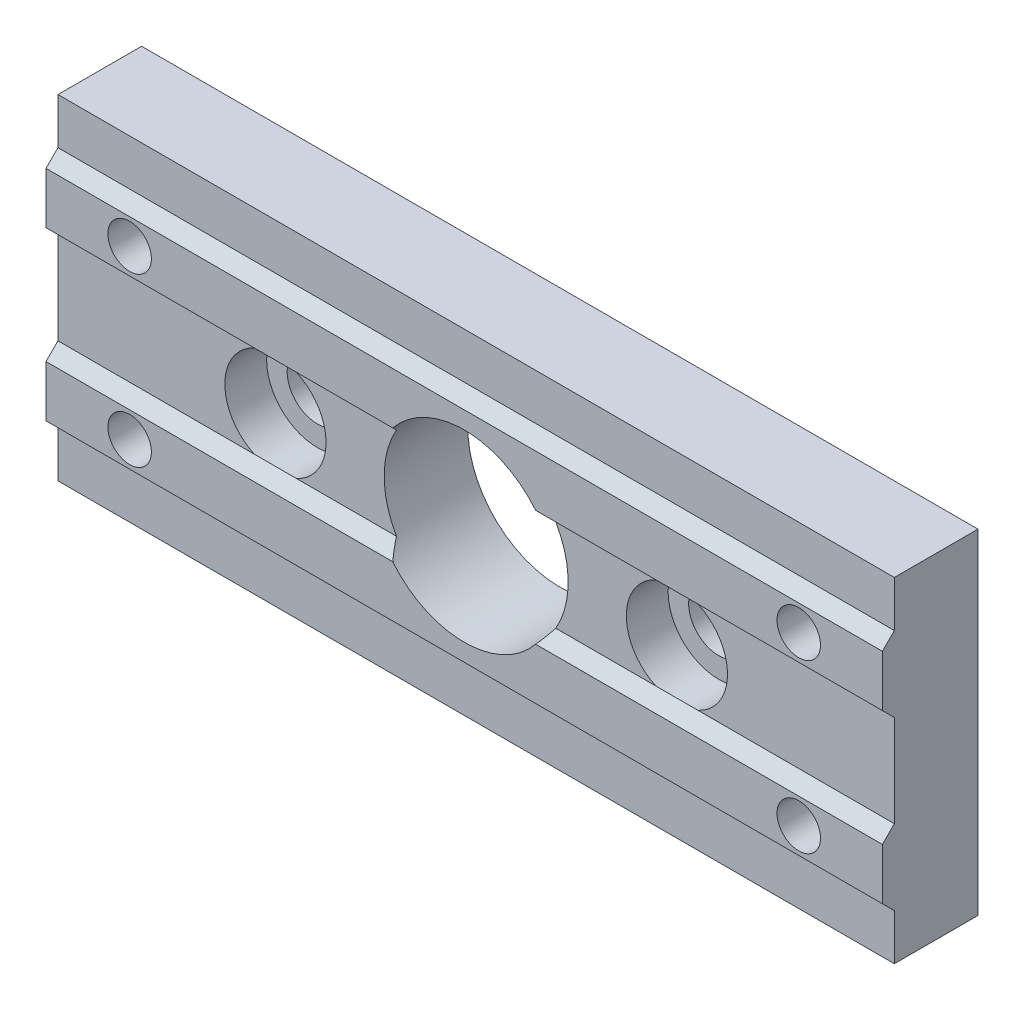
ISO-10303-21;
HEADER;
FILE_DESCRIPTION(('STEP AP214'),'2;1');
FILE_NAME('part.step','',(''),(''),'','','');
FILE_SCHEMA(('AUTOMOTIVE_DESIGN { 1 0 10303 214 1 1 1 1 }'));
ENDSEC;
DATA;
#1=APPLICATION_CONTEXT('core data for automotive mechanical design processes');
#2=APPLICATION_PROTOCOL_DEFINITION('international standard','automotive_design',2000,#1);
#3=PRODUCT_CONTEXT('',#1,'mechanical');
#4=PRODUCT('Part','Part','',(#3));
#5=PRODUCT_RELATED_PRODUCT_CATEGORY('part','',(#4));
#6=PRODUCT_DEFINITION_FORMATION('','',#4);
#7=PRODUCT_DEFINITION_CONTEXT('part definition',#1,'design');
#8=PRODUCT_DEFINITION('design','',#6,#7);
#9=PRODUCT_DEFINITION_SHAPE('','',#8);
#10=(LENGTH_UNIT() NAMED_UNIT(*) SI_UNIT(.MILLI.,.METRE.));
#11=(NAMED_UNIT(*) PLANE_ANGLE_UNIT() SI_UNIT($,.RADIAN.));
#12=(NAMED_UNIT(*) SI_UNIT($,.STERADIAN.) SOLID_ANGLE_UNIT());
#13=UNCERTAINTY_MEASURE_WITH_UNIT(LENGTH_MEASURE(1.E-05),#10,'distance_accuracy_value','');
#14=(GEOMETRIC_REPRESENTATION_CONTEXT(3) GLOBAL_UNCERTAINTY_ASSIGNED_CONTEXT((#13)) GLOBAL_UNIT_ASSIGNED_CONTEXT((#10,
#11,#12)) REPRESENTATION_CONTEXT('',''));
#15=CARTESIAN_POINT('',(0.,0.,0.));
#16=DIRECTION('',(0.,0.,1.));
#17=DIRECTION('',(1.,0.,0.));
#18=AXIS2_PLACEMENT_3D('',#15,#16,#17);
#19=CARTESIAN_POINT('',(59.1128974536094,-6.93000000000001,11.43));
#20=DIRECTION('',(0.,-0.707106781186547,-0.707106781186548));
#21=DIRECTION('',(-1.,0.,0.));
#22=AXIS2_PLACEMENT_3D('',#19,#20,#21);
#23=PLANE('',#22);
#24=CARTESIAN_POINT('',(0.,0.,4.5));
#25=DIRECTION('',(0.,-0.707106781186547,-0.707106781186548));
#26=DIRECTION('',(0.,0.707106781186548,-0.707106781186547));
#27=AXIS2_PLACEMENT_3D('',#24,#25,#26);
#28=ELLIPSE('',#27,15.556349186104,11.);
#29=CARTESIAN_POINT('',(-9.52627944162882,-5.50000000000001,10.));
#30=VERTEX_POINT('',#29);
#31=CARTESIAN_POINT('',(-8.54254645875572,-6.93000000000001,11.43));
#32=VERTEX_POINT('',#31);
#33=EDGE_CURVE('E414',#30,#32,#28,.F.);
#34=ORIENTED_EDGE('',*,*,#33,.F.);
#35=DIRECTION('',(-1.,0.,0.));
#36=VECTOR('',#35,1.);
#37=CARTESIAN_POINT('',(59.1128974536094,-5.50000000000001,10.));
#38=LINE('',#37,#36);
#39=CARTESIAN_POINT('',(-21.4795833677743,-5.50000000000001,10.));
#40=VERTEX_POINT('',#39);
#41=EDGE_CURVE('E450',#30,#40,#38,.T.);
#42=ORIENTED_EDGE('',*,*,#41,.T.);
#43=CARTESIAN_POINT('',(-26.5204166322257,-5.50000000000001,10.));
#44=VERTEX_POINT('',#43);
#45=EDGE_CURVE('E389',#40,#44,#38,.T.);
#46=ORIENTED_EDGE('',*,*,#45,.T.);
#47=CARTESIAN_POINT('',(-50.,-5.50000000000001,10.));
#48=VERTEX_POINT('',#47);
#49=EDGE_CURVE('E274',#44,#48,#38,.T.);
#50=ORIENTED_EDGE('',*,*,#49,.T.);
#51=DIRECTION('',(0.,-0.707106781186548,0.707106781186547));
#52=VECTOR('',#51,1.);
#53=CARTESIAN_POINT('',(-50.,-6.93000000000001,11.43));
#54=LINE('',#53,#52);
#55=CARTESIAN_POINT('',(-50.,-6.93000000000001,11.43));
#56=VERTEX_POINT('',#55);
#57=EDGE_CURVE('E232',#56,#48,#54,.F.);
#58=ORIENTED_EDGE('',*,*,#57,.F.);
#59=DIRECTION('',(-1.,0.,0.));
#60=VECTOR('',#59,1.);
#61=CARTESIAN_POINT('',(59.1128974536094,-6.93000000000001,11.43));
#62=LINE('',#61,#60);
#63=EDGE_CURVE('E228',#32,#56,#62,.T.);
#64=ORIENTED_EDGE('',*,*,#63,.F.);
#65=EDGE_LOOP('',(#34,#42,#46,#50,#58,#64));
#66=FACE_BOUND('',#65,.T.);
#67=ADVANCED_FACE('F43',(#66),#23,.F.);
#68=CARTESIAN_POINT('',(59.1128974536094,5.5,10.));
#69=DIRECTION('',(0.,0.707106781186547,-0.707106781186548));
#70=DIRECTION('',(-1.,0.,0.));
#71=AXIS2_PLACEMENT_3D('',#68,#69,#70);
#72=PLANE('',#71);
#73=CARTESIAN_POINT('',(0.,0.,4.50000000000001));
#74=DIRECTION('',(0.,0.707106781186547,-0.707106781186548));
#75=DIRECTION('',(0.,-0.707106781186548,-0.707106781186547));
#76=AXIS2_PLACEMENT_3D('',#73,#74,#75);
#77=ELLIPSE('',#76,15.556349186104,11.);
#78=CARTESIAN_POINT('',(9.52627944162882,5.50000000000001,10.));
#79=VERTEX_POINT('',#78);
#80=CARTESIAN_POINT('',(8.54254645875573,6.93,11.43));
#81=VERTEX_POINT('',#80);
#82=EDGE_CURVE('E11',#79,#81,#77,.F.);
#83=ORIENTED_EDGE('',*,*,#82,.F.);
#84=DIRECTION('',(-1.,0.,0.));
#85=VECTOR('',#84,1.);
#86=CARTESIAN_POINT('',(59.1128974536094,5.5,10.));
#87=LINE('',#86,#85);
#88=CARTESIAN_POINT('',(21.4795833677743,5.5,10.));
#89=VERTEX_POINT('',#88);
#90=EDGE_CURVE('E475',#89,#79,#87,.T.);
#91=ORIENTED_EDGE('',*,*,#90,.F.);
#92=CARTESIAN_POINT('',(26.5204166322257,5.5,10.));
#93=VERTEX_POINT('',#92);
#94=EDGE_CURVE('E409',#93,#89,#87,.T.);
#95=ORIENTED_EDGE('',*,*,#94,.F.);
#96=CARTESIAN_POINT('',(50.,5.5,10.));
#97=VERTEX_POINT('',#96);
#98=EDGE_CURVE('E405',#97,#93,#87,.T.);
#99=ORIENTED_EDGE('',*,*,#98,.F.);
#100=DIRECTION('',(0.,0.707106781186548,0.707106781186547));
#101=VECTOR('',#100,1.);
#102=CARTESIAN_POINT('',(50.,5.5,10.));
#103=LINE('',#102,#101);
#104=CARTESIAN_POINT('',(50.,6.93,11.43));
#105=VERTEX_POINT('',#104);
#106=EDGE_CURVE('E202',#105,#97,#103,.F.);
#107=ORIENTED_EDGE('',*,*,#106,.F.);
#108=DIRECTION('',(1.,0.,0.));
#109=VECTOR('',#108,1.);
#110=CARTESIAN_POINT('',(59.1128974536094,6.93,11.43));
#111=LINE('',#110,#109);
#112=EDGE_CURVE('E191',#81,#105,#111,.T.);
#113=ORIENTED_EDGE('',*,*,#112,.F.);
#114=EDGE_LOOP('',(#83,#91,#95,#99,#107,#113));
#115=FACE_BOUND('',#114,.T.);
#116=ADVANCED_FACE('F200',(#115),#72,.F.);
#117=CARTESIAN_POINT('',(0.,0.,10.));
#118=DIRECTION('',(0.,0.,-1.));
#119=DIRECTION('',(-1.,0.,0.));
#120=AXIS2_PLACEMENT_3D('',#117,#118,#119);
#121=PLANE('',#120);
#122=CARTESIAN_POINT('',(-26.5204166322257,5.5,10.));
#123=VERTEX_POINT('',#122);
#124=CARTESIAN_POINT('',(-50.,5.5,10.));
#125=VERTEX_POINT('',#124);
#126=EDGE_CURVE('E410',#123,#125,#87,.T.);
#127=ORIENTED_EDGE('',*,*,#126,.T.);
#128=DIRECTION('',(0.,-1.,0.));
#129=VECTOR('',#128,1.);
#130=CARTESIAN_POINT('',(-50.,-20.,10.));
#131=LINE('',#130,#129);
#132=EDGE_CURVE('E308',#125,#48,#131,.T.);
#133=ORIENTED_EDGE('',*,*,#132,.T.);
#134=ORIENTED_EDGE('',*,*,#49,.F.);
#135=CARTESIAN_POINT('',(-24.,0.,10.));
#136=DIRECTION('',(0.,0.,-1.));
#137=DIRECTION('',(-1.,0.,0.));
#138=AXIS2_PLACEMENT_3D('',#135,#136,#137);
#139=CIRCLE('',#138,6.05);
#140=EDGE_CURVE('E336',#44,#123,#139,.T.);
#141=ORIENTED_EDGE('',*,*,#140,.T.);
#142=EDGE_LOOP('',(#127,#133,#134,#141));
#143=FACE_BOUND('',#142,.T.);
#144=ADVANCED_FACE('F498',(#143),#121,.F.);
#145=CARTESIAN_POINT('',(-9.52627944162882,5.5,10.));
#146=VERTEX_POINT('',#145);
#147=CARTESIAN_POINT('',(-21.4795833677743,5.5,10.));
#148=VERTEX_POINT('',#147);
#149=EDGE_CURVE('E477',#146,#148,#87,.T.);
#150=ORIENTED_EDGE('',*,*,#149,.T.);
#151=EDGE_CURVE('E246',#148,#40,#139,.T.);
#152=ORIENTED_EDGE('',*,*,#151,.T.);
#153=ORIENTED_EDGE('',*,*,#41,.F.);
#154=CARTESIAN_POINT('',(0.,0.,10.));
#155=DIRECTION('',(0.,0.,1.));
#156=DIRECTION('',(1.,0.,0.));
#157=AXIS2_PLACEMENT_3D('',#154,#155,#156);
#158=CIRCLE('',#157,11.);
#159=EDGE_CURVE('E322',#146,#30,#158,.T.);
#160=ORIENTED_EDGE('',*,*,#159,.F.);
#161=EDGE_LOOP('',(#150,#152,#153,#160));
#162=FACE_BOUND('',#161,.T.);
#163=ADVANCED_FACE('F488',(#162),#121,.F.);
#164=ORIENTED_EDGE('',*,*,#90,.T.);
#165=CARTESIAN_POINT('',(9.52627944162882,-5.50000000000001,10.));
#166=VERTEX_POINT('',#165);
#167=EDGE_CURVE('E182',#166,#79,#158,.T.);
#168=ORIENTED_EDGE('',*,*,#167,.F.);
#169=CARTESIAN_POINT('',(21.4795833677743,-5.50000000000001,10.));
#170=VERTEX_POINT('',#169);
#171=EDGE_CURVE('E241',#170,#166,#38,.T.);
#172=ORIENTED_EDGE('',*,*,#171,.F.);
#173=CARTESIAN_POINT('',(24.,0.,10.));
#174=DIRECTION('',(0.,0.,-1.));
#175=DIRECTION('',(-1.,0.,0.));
#176=AXIS2_PLACEMENT_3D('',#173,#174,#175);
#177=CIRCLE('',#176,6.05);
#178=EDGE_CURVE('E344',#170,#89,#177,.T.);
#179=ORIENTED_EDGE('',*,*,#178,.T.);
#180=EDGE_LOOP('',(#164,#168,#172,#179));
#181=FACE_BOUND('',#180,.T.);
#182=ADVANCED_FACE('F551',(#181),#121,.F.);
#183=ORIENTED_EDGE('',*,*,#98,.T.);
#184=CARTESIAN_POINT('',(26.5204166322257,-5.50000000000001,10.));
#185=VERTEX_POINT('',#184);
#186=EDGE_CURVE('E340',#93,#185,#177,.T.);
#187=ORIENTED_EDGE('',*,*,#186,.T.);
#188=CARTESIAN_POINT('',(50.,-5.50000000000001,10.));
#189=VERTEX_POINT('',#188);
#190=EDGE_CURVE('E384',#189,#185,#38,.T.);
#191=ORIENTED_EDGE('',*,*,#190,.F.);
#192=DIRECTION('',(0.,1.,0.));
#193=VECTOR('',#192,1.);
#194=CARTESIAN_POINT('',(50.,-20.,10.));
#195=LINE('',#194,#193);
#196=EDGE_CURVE('E317',#189,#97,#195,.T.);
#197=ORIENTED_EDGE('',*,*,#196,.T.);
#198=EDGE_LOOP('',(#183,#187,#191,#197));
#199=FACE_BOUND('',#198,.T.);
#200=ADVANCED_FACE('F557',(#199),#121,.F.);
#201=DIRECTION('',(-1.,0.,0.));
#202=VECTOR('',#201,1.);
#203=CARTESIAN_POINT('',(59.1128974536094,14.5,10.));
#204=LINE('',#203,#202);
#205=CARTESIAN_POINT('',(50.,14.5,10.));
#206=VERTEX_POINT('',#205);
#207=CARTESIAN_POINT('',(-50.,14.5,10.));
#208=VERTEX_POINT('',#207);
#209=EDGE_CURVE('E401',#206,#208,#204,.T.);
#210=ORIENTED_EDGE('',*,*,#209,.F.);
#211=CARTESIAN_POINT('',(50.,20.,10.));
#212=VERTEX_POINT('',#211);
#213=EDGE_CURVE('E291',#206,#212,#195,.T.);
#214=ORIENTED_EDGE('',*,*,#213,.T.);
#215=DIRECTION('',(-1.,0.,0.));
#216=VECTOR('',#215,1.);
#217=CARTESIAN_POINT('',(-50.,20.,10.));
#218=LINE('',#217,#216);
#219=CARTESIAN_POINT('',(-50.,20.,10.));
#220=VERTEX_POINT('',#219);
#221=EDGE_CURVE('E310',#212,#220,#218,.T.);
#222=ORIENTED_EDGE('',*,*,#221,.T.);
#223=EDGE_CURVE('E304',#220,#208,#131,.T.);
#224=ORIENTED_EDGE('',*,*,#223,.T.);
#225=EDGE_LOOP('',(#210,#214,#222,#224));
#226=FACE_BOUND('',#225,.T.);
#227=ADVANCED_FACE('F516',(#226),#121,.F.);
#228=CARTESIAN_POINT('',(50.,-20.,10.));
#229=VERTEX_POINT('',#228);
#230=CARTESIAN_POINT('',(50.,-14.5,10.));
#231=VERTEX_POINT('',#230);
#232=EDGE_CURVE('E313',#229,#231,#195,.T.);
#233=ORIENTED_EDGE('',*,*,#232,.T.);
#234=DIRECTION('',(-1.,0.,0.));
#235=VECTOR('',#234,1.);
#236=CARTESIAN_POINT('',(59.1128974536094,-14.5,10.));
#237=LINE('',#236,#235);
#238=CARTESIAN_POINT('',(-50.,-14.5,10.));
#239=VERTEX_POINT('',#238);
#240=EDGE_CURVE('E380',#231,#239,#237,.T.);
#241=ORIENTED_EDGE('',*,*,#240,.T.);
#242=CARTESIAN_POINT('',(-50.,-20.,10.));
#243=VERTEX_POINT('',#242);
#244=EDGE_CURVE('E309',#239,#243,#131,.T.);
#245=ORIENTED_EDGE('',*,*,#244,.T.);
#246=DIRECTION('',(1.,0.,0.));
#247=VECTOR('',#246,1.);
#248=CARTESIAN_POINT('',(-50.,-20.,10.));
#249=LINE('',#248,#247);
#250=EDGE_CURVE('E287',#243,#229,#249,.T.);
#251=ORIENTED_EDGE('',*,*,#250,.T.);
#252=EDGE_LOOP('',(#233,#241,#245,#251));
#253=FACE_BOUND('',#252,.T.);
#254=ADVANCED_FACE('F541',(#253),#121,.F.);
#255=CARTESIAN_POINT('',(0.,0.,0.));
#256=DIRECTION('',(0.,0.,-1.));
#257=DIRECTION('',(-1.,0.,0.));
#258=AXIS2_PLACEMENT_3D('',#255,#256,#257);
#259=PLANE('',#258);
#260=CARTESIAN_POINT('',(40.,-10.,0.));
#261=DIRECTION('',(0.,0.,1.));
#262=DIRECTION('',(1.,0.,0.));
#263=AXIS2_PLACEMENT_3D('',#260,#261,#262);
#264=CIRCLE('',#263,4.5);
#265=CARTESIAN_POINT('',(44.5,-10.,0.));
#266=VERTEX_POINT('',#265);
#267=EDGE_CURVE('E365',#266,#266,#264,.T.);
#268=ORIENTED_EDGE('',*,*,#267,.T.);
#269=EDGE_LOOP('',(#268));
#270=FACE_BOUND('',#269,.T.);
#271=CARTESIAN_POINT('',(-40.,10.,0.));
#272=DIRECTION('',(0.,0.,1.));
#273=DIRECTION('',(1.,0.,0.));
#274=AXIS2_PLACEMENT_3D('',#271,#272,#273);
#275=CIRCLE('',#274,4.5);
#276=CARTESIAN_POINT('',(-35.5,10.,0.));
#277=VERTEX_POINT('',#276);
#278=EDGE_CURVE('E356',#277,#277,#275,.T.);
#279=ORIENTED_EDGE('',*,*,#278,.T.);
#280=EDGE_LOOP('',(#279));
#281=FACE_BOUND('',#280,.T.);
#282=CARTESIAN_POINT('',(-40.,-10.,0.));
#283=DIRECTION('',(0.,0.,1.));
#284=DIRECTION('',(1.,0.,0.));
#285=AXIS2_PLACEMENT_3D('',#282,#283,#284);
#286=CIRCLE('',#285,4.5);
#287=CARTESIAN_POINT('',(-35.5,-10.,0.));
#288=VERTEX_POINT('',#287);
#289=EDGE_CURVE('E372',#288,#288,#286,.T.);
#290=ORIENTED_EDGE('',*,*,#289,.T.);
#291=EDGE_LOOP('',(#290));
#292=FACE_BOUND('',#291,.T.);
#293=CARTESIAN_POINT('',(40.,10.,0.));
#294=DIRECTION('',(0.,0.,1.));
#295=DIRECTION('',(1.,0.,0.));
#296=AXIS2_PLACEMENT_3D('',#293,#294,#295);
#297=CIRCLE('',#296,4.5);
#298=CARTESIAN_POINT('',(44.5,10.,0.));
#299=VERTEX_POINT('',#298);
#300=EDGE_CURVE('E348',#299,#299,#297,.T.);
#301=ORIENTED_EDGE('',*,*,#300,.T.);
#302=EDGE_LOOP('',(#301));
#303=FACE_BOUND('',#302,.T.);
#304=CARTESIAN_POINT('',(-24.,0.,0.));
#305=DIRECTION('',(0.,0.,1.));
#306=DIRECTION('',(1.,0.,0.));
#307=AXIS2_PLACEMENT_3D('',#304,#305,#306);
#308=CIRCLE('',#307,3.6);
#309=CARTESIAN_POINT('',(-20.4,0.,0.));
#310=VERTEX_POINT('',#309);
#311=EDGE_CURVE('E323',#310,#310,#308,.T.);
#312=ORIENTED_EDGE('',*,*,#311,.T.);
#313=EDGE_LOOP('',(#312));
#314=FACE_BOUND('',#313,.T.);
#315=DIRECTION('',(0.,1.,0.));
#316=VECTOR('',#315,1.);
#317=CARTESIAN_POINT('',(50.,-20.,0.));
#318=LINE('',#317,#316);
#319=CARTESIAN_POINT('',(50.,-20.,0.));
#320=VERTEX_POINT('',#319);
#321=CARTESIAN_POINT('',(50.,20.,0.));
#322=VERTEX_POINT('',#321);
#323=EDGE_CURVE('E298',#320,#322,#318,.T.);
#324=ORIENTED_EDGE('',*,*,#323,.F.);
#325=DIRECTION('',(1.,0.,0.));
#326=VECTOR('',#325,1.);
#327=CARTESIAN_POINT('',(-50.,-20.,0.));
#328=LINE('',#327,#326);
#329=CARTESIAN_POINT('',(-50.,-20.,0.));
#330=VERTEX_POINT('',#329);
#331=EDGE_CURVE('E288',#330,#320,#328,.T.);
#332=ORIENTED_EDGE('',*,*,#331,.F.);
#333=DIRECTION('',(0.,-1.,0.));
#334=VECTOR('',#333,1.);
#335=CARTESIAN_POINT('',(-50.,-20.,0.));
#336=LINE('',#335,#334);
#337=CARTESIAN_POINT('',(-50.,20.,0.));
#338=VERTEX_POINT('',#337);
#339=EDGE_CURVE('E292',#338,#330,#336,.T.);
#340=ORIENTED_EDGE('',*,*,#339,.F.);
#341=DIRECTION('',(-1.,0.,0.));
#342=VECTOR('',#341,1.);
#343=CARTESIAN_POINT('',(-50.,20.,0.));
#344=LINE('',#343,#342);
#345=EDGE_CURVE('E295',#322,#338,#344,.T.);
#346=ORIENTED_EDGE('',*,*,#345,.F.);
#347=EDGE_LOOP('',(#324,#332,#340,#346));
#348=FACE_BOUND('',#347,.T.);
#349=CARTESIAN_POINT('',(0.,0.,0.));
#350=DIRECTION('',(0.,0.,1.));
#351=DIRECTION('',(1.,0.,0.));
#352=AXIS2_PLACEMENT_3D('',#349,#350,#351);
#353=CIRCLE('',#352,11.);
#354=CARTESIAN_POINT('',(11.,0.,0.));
#355=VERTEX_POINT('',#354);
#356=EDGE_CURVE('E318',#355,#355,#353,.T.);
#357=ORIENTED_EDGE('',*,*,#356,.T.);
#358=EDGE_LOOP('',(#357));
#359=FACE_BOUND('',#358,.T.);
#360=CARTESIAN_POINT('',(24.,0.,0.));
#361=DIRECTION('',(0.,0.,1.));
#362=DIRECTION('',(1.,0.,0.));
#363=AXIS2_PLACEMENT_3D('',#360,#361,#362);
#364=CIRCLE('',#363,3.6);
#365=CARTESIAN_POINT('',(27.6,0.,0.));
#366=VERTEX_POINT('',#365);
#367=EDGE_CURVE('E264',#366,#366,#364,.T.);
#368=ORIENTED_EDGE('',*,*,#367,.T.);
#369=EDGE_LOOP('',(#368));
#370=FACE_BOUND('',#369,.T.);
#371=ADVANCED_FACE('F528',(#270,#281,#292,#303,#314,#348,#359,#370),#259,.T.);
#372=CARTESIAN_POINT('',(50.,-20.,10.));
#373=DIRECTION('',(-1.,0.,0.));
#374=DIRECTION('',(0.,0.,1.));
#375=AXIS2_PLACEMENT_3D('',#372,#373,#374);
#376=PLANE('',#375);
#377=DIRECTION('',(0.,1.,0.));
#378=VECTOR('',#377,1.);
#379=CARTESIAN_POINT('',(50.,-20.,11.43));
#380=LINE('',#379,#378);
#381=CARTESIAN_POINT('',(50.,-13.07,11.43));
#382=VERTEX_POINT('',#381);
#383=CARTESIAN_POINT('',(50.,-6.93000000000001,11.43));
#384=VERTEX_POINT('',#383);
#385=EDGE_CURVE('E376',#382,#384,#380,.T.);
#386=ORIENTED_EDGE('',*,*,#385,.F.);
#387=DIRECTION('',(0.,0.707106781186548,0.707106781186547));
#388=VECTOR('',#387,1.);
#389=CARTESIAN_POINT('',(50.,-14.5,10.));
#390=LINE('',#389,#388);
#391=EDGE_CURVE('E208',#382,#231,#390,.F.);
#392=ORIENTED_EDGE('',*,*,#391,.T.);
#393=ORIENTED_EDGE('',*,*,#232,.F.);
#394=DIRECTION('',(0.,0.,-1.));
#395=VECTOR('',#394,1.);
#396=CARTESIAN_POINT('',(50.,-20.,10.));
#397=LINE('',#396,#395);
#398=EDGE_CURVE('E283',#229,#320,#397,.T.);
#399=ORIENTED_EDGE('',*,*,#398,.T.);
#400=ORIENTED_EDGE('',*,*,#323,.T.);
#401=DIRECTION('',(0.,0.,-1.));
#402=VECTOR('',#401,1.);
#403=CARTESIAN_POINT('',(50.,20.,10.));
#404=LINE('',#403,#402);
#405=EDGE_CURVE('E270',#212,#322,#404,.T.);
#406=ORIENTED_EDGE('',*,*,#405,.F.);
#407=ORIENTED_EDGE('',*,*,#213,.F.);
#408=DIRECTION('',(0.,0.707106781186548,-0.707106781186547));
#409=VECTOR('',#408,1.);
#410=CARTESIAN_POINT('',(50.,13.07,11.43));
#411=LINE('',#410,#409);
#412=CARTESIAN_POINT('',(50.,13.07,11.43));
#413=VERTEX_POINT('',#412);
#414=EDGE_CURVE('E218',#206,#413,#411,.F.);
#415=ORIENTED_EDGE('',*,*,#414,.T.);
#416=DIRECTION('',(0.,1.,0.));
#417=VECTOR('',#416,1.);
#418=CARTESIAN_POINT('',(50.,-20.,11.43));
#419=LINE('',#418,#417);
#420=EDGE_CURVE('E400',#105,#413,#419,.T.);
#421=ORIENTED_EDGE('',*,*,#420,.F.);
#422=ORIENTED_EDGE('',*,*,#106,.T.);
#423=ORIENTED_EDGE('',*,*,#196,.F.);
#424=DIRECTION('',(0.,0.707106781186548,-0.707106781186547));
#425=VECTOR('',#424,1.);
#426=CARTESIAN_POINT('',(50.,-6.93000000000001,11.43));
#427=LINE('',#426,#425);
#428=EDGE_CURVE('E213',#189,#384,#427,.F.);
#429=ORIENTED_EDGE('',*,*,#428,.T.);
#430=EDGE_LOOP('',(#386,#392,#393,#399,#400,#406,#407,#415,#421,#422,#423,#429));
#431=FACE_BOUND('',#430,.T.);
#432=ADVANCED_FACE('F537',(#431),#376,.F.);
#433=CARTESIAN_POINT('',(-50.,20.,10.));
#434=DIRECTION('',(0.,-1.,0.));
#435=DIRECTION('',(0.,0.,-1.));
#436=AXIS2_PLACEMENT_3D('',#433,#434,#435);
#437=PLANE('',#436);
#438=ORIENTED_EDGE('',*,*,#345,.T.);
#439=DIRECTION('',(0.,0.,-1.));
#440=VECTOR('',#439,1.);
#441=CARTESIAN_POINT('',(-50.,20.,10.));
#442=LINE('',#441,#440);
#443=EDGE_CURVE('E275',#220,#338,#442,.T.);
#444=ORIENTED_EDGE('',*,*,#443,.F.);
#445=ORIENTED_EDGE('',*,*,#221,.F.);
#446=ORIENTED_EDGE('',*,*,#405,.T.);
#447=EDGE_LOOP('',(#438,#444,#445,#446));
#448=FACE_BOUND('',#447,.T.);
#449=ADVANCED_FACE('F522',(#448),#437,.F.);
#450=CARTESIAN_POINT('',(-50.,-20.,10.));
#451=DIRECTION('',(1.,0.,0.));
#452=DIRECTION('',(0.,0.,-1.));
#453=AXIS2_PLACEMENT_3D('',#450,#451,#452);
#454=PLANE('',#453);
#455=ORIENTED_EDGE('',*,*,#244,.F.);
#456=DIRECTION('',(0.,-0.707106781186548,-0.707106781186547));
#457=VECTOR('',#456,1.);
#458=CARTESIAN_POINT('',(-50.,-14.5,10.));
#459=LINE('',#458,#457);
#460=CARTESIAN_POINT('',(-50.,-13.07,11.43));
#461=VERTEX_POINT('',#460);
#462=EDGE_CURVE('E229',#239,#461,#459,.F.);
#463=ORIENTED_EDGE('',*,*,#462,.T.);
#464=DIRECTION('',(0.,-1.,0.));
#465=VECTOR('',#464,1.);
#466=CARTESIAN_POINT('',(-50.,-20.,11.43));
#467=LINE('',#466,#465);
#468=EDGE_CURVE('E390',#56,#461,#467,.T.);
#469=ORIENTED_EDGE('',*,*,#468,.F.);
#470=ORIENTED_EDGE('',*,*,#57,.T.);
#471=ORIENTED_EDGE('',*,*,#132,.F.);
#472=DIRECTION('',(0.,-0.707106781186548,-0.707106781186547));
#473=VECTOR('',#472,1.);
#474=CARTESIAN_POINT('',(-50.,5.5,10.));
#475=LINE('',#474,#473);
#476=CARTESIAN_POINT('',(-50.,6.93,11.43));
#477=VERTEX_POINT('',#476);
#478=EDGE_CURVE('E235',#125,#477,#475,.F.);
#479=ORIENTED_EDGE('',*,*,#478,.T.);
#480=DIRECTION('',(0.,-1.,0.));
#481=VECTOR('',#480,1.);
#482=CARTESIAN_POINT('',(-50.,-20.,11.43));
#483=LINE('',#482,#481);
#484=CARTESIAN_POINT('',(-50.,13.07,11.43));
#485=VERTEX_POINT('',#484);
#486=EDGE_CURVE('E411',#485,#477,#483,.T.);
#487=ORIENTED_EDGE('',*,*,#486,.F.);
#488=DIRECTION('',(0.,-0.707106781186548,0.707106781186547));
#489=VECTOR('',#488,1.);
#490=CARTESIAN_POINT('',(-50.,13.07,11.43));
#491=LINE('',#490,#489);
#492=EDGE_CURVE('E238',#485,#208,#491,.F.);
#493=ORIENTED_EDGE('',*,*,#492,.T.);
#494=ORIENTED_EDGE('',*,*,#223,.F.);
#495=ORIENTED_EDGE('',*,*,#443,.T.);
#496=ORIENTED_EDGE('',*,*,#339,.T.);
#497=DIRECTION('',(0.,0.,-1.));
#498=VECTOR('',#497,1.);
#499=CARTESIAN_POINT('',(-50.,-20.,10.));
#500=LINE('',#499,#498);
#501=EDGE_CURVE('E279',#243,#330,#500,.T.);
#502=ORIENTED_EDGE('',*,*,#501,.F.);
#503=EDGE_LOOP('',(#455,#463,#469,#470,#471,#479,#487,#493,#494,#495,#496,#502));
#504=FACE_BOUND('',#503,.T.);
#505=ADVANCED_FACE('F510',(#504),#454,.F.);
#506=CARTESIAN_POINT('',(-50.,-20.,10.));
#507=DIRECTION('',(0.,1.,0.));
#508=DIRECTION('',(0.,0.,1.));
#509=AXIS2_PLACEMENT_3D('',#506,#507,#508);
#510=PLANE('',#509);
#511=ORIENTED_EDGE('',*,*,#331,.T.);
#512=ORIENTED_EDGE('',*,*,#398,.F.);
#513=ORIENTED_EDGE('',*,*,#250,.F.);
#514=ORIENTED_EDGE('',*,*,#501,.T.);
#515=EDGE_LOOP('',(#511,#512,#513,#514));
#516=FACE_BOUND('',#515,.T.);
#517=ADVANCED_FACE('F532',(#516),#510,.F.);
#518=CARTESIAN_POINT('',(0.,0.,10.));
#519=DIRECTION('',(0.,0.,-1.));
#520=DIRECTION('',(-1.,0.,0.));
#521=AXIS2_PLACEMENT_3D('',#518,#519,#520);
#522=CYLINDRICAL_SURFACE('',#521,11.);
#523=ORIENTED_EDGE('',*,*,#159,.T.);
#524=ORIENTED_EDGE('',*,*,#33,.T.);
#525=CARTESIAN_POINT('',(0.,0.,11.43));
#526=DIRECTION('',(0.,0.,-1.));
#527=DIRECTION('',(-1.,0.,0.));
#528=AXIS2_PLACEMENT_3D('',#525,#526,#527);
#529=CIRCLE('',#528,11.);
#530=CARTESIAN_POINT('',(8.54254645875572,-6.93000000000001,11.43));
#531=VERTEX_POINT('',#530);
#532=EDGE_CURVE('E60',#531,#32,#529,.T.);
#533=ORIENTED_EDGE('',*,*,#532,.F.);
#534=EDGE_CURVE('E197',#531,#166,#28,.F.);
#535=ORIENTED_EDGE('',*,*,#534,.T.);
#536=ORIENTED_EDGE('',*,*,#167,.T.);
#537=ORIENTED_EDGE('',*,*,#82,.T.);
#538=CARTESIAN_POINT('',(-8.54254645875572,6.93,11.43));
#539=VERTEX_POINT('',#538);
#540=EDGE_CURVE('E66',#539,#81,#529,.T.);
#541=ORIENTED_EDGE('',*,*,#540,.F.);
#542=EDGE_CURVE('E48',#539,#146,#77,.F.);
#543=ORIENTED_EDGE('',*,*,#542,.T.);
#544=EDGE_LOOP('',(#523,#524,#533,#535,#536,#537,#541,#543));
#545=FACE_BOUND('',#544,.T.);
#546=ORIENTED_EDGE('',*,*,#356,.F.);
#547=EDGE_LOOP('',(#546));
#548=FACE_BOUND('',#547,.T.);
#549=ADVANCED_FACE('F179',(#545,#548),#522,.F.);
#550=CARTESIAN_POINT('',(-40.,10.,10.));
#551=DIRECTION('',(0.,0.,-1.));
#552=DIRECTION('',(-1.,0.,0.));
#553=AXIS2_PLACEMENT_3D('',#550,#551,#552);
#554=CYLINDRICAL_SURFACE('',#553,2.6);
#555=CARTESIAN_POINT('',(-40.,10.,5.));
#556=DIRECTION('',(0.,0.,1.));
#557=DIRECTION('',(1.,0.,0.));
#558=AXIS2_PLACEMENT_3D('',#555,#556,#557);
#559=CIRCLE('',#558,2.6);
#560=CARTESIAN_POINT('',(-37.4,10.,5.));
#561=VERTEX_POINT('',#560);
#562=EDGE_CURVE('E242',#561,#561,#559,.T.);
#563=ORIENTED_EDGE('',*,*,#562,.F.);
#564=EDGE_LOOP('',(#563));
#565=FACE_BOUND('',#564,.T.);
#566=CARTESIAN_POINT('',(-40.,10.,11.43));
#567=DIRECTION('',(0.,0.,-1.));
#568=DIRECTION('',(-1.,0.,0.));
#569=AXIS2_PLACEMENT_3D('',#566,#567,#568);
#570=CIRCLE('',#569,2.6);
#571=CARTESIAN_POINT('',(-42.6,10.,11.43));
#572=VERTEX_POINT('',#571);
#573=EDGE_CURVE('E431',#572,#572,#570,.T.);
#574=ORIENTED_EDGE('',*,*,#573,.F.);
#575=EDGE_LOOP('',(#574));
#576=FACE_BOUND('',#575,.T.);
#577=ADVANCED_FACE('F611',(#565,#576),#554,.F.);
#578=CARTESIAN_POINT('',(-40.,-10.,10.));
#579=DIRECTION('',(0.,0.,-1.));
#580=DIRECTION('',(-1.,0.,0.));
#581=AXIS2_PLACEMENT_3D('',#578,#579,#580);
#582=CYLINDRICAL_SURFACE('',#581,2.6);
#583=CARTESIAN_POINT('',(-40.,-10.,5.));
#584=DIRECTION('',(0.,0.,1.));
#585=DIRECTION('',(1.,0.,0.));
#586=AXIS2_PLACEMENT_3D('',#583,#584,#585);
#587=CIRCLE('',#586,2.6);
#588=CARTESIAN_POINT('',(-37.4,-10.,5.));
#589=VERTEX_POINT('',#588);
#590=EDGE_CURVE('E247',#589,#589,#587,.T.);
#591=ORIENTED_EDGE('',*,*,#590,.F.);
#592=EDGE_LOOP('',(#591));
#593=FACE_BOUND('',#592,.T.);
#594=CARTESIAN_POINT('',(-40.,-10.,11.43));
#595=DIRECTION('',(0.,0.,-1.));
#596=DIRECTION('',(-1.,0.,0.));
#597=AXIS2_PLACEMENT_3D('',#594,#595,#596);
#598=CIRCLE('',#597,2.6);
#599=CARTESIAN_POINT('',(-42.6,-10.,11.43));
#600=VERTEX_POINT('',#599);
#601=EDGE_CURVE('E427',#600,#600,#598,.T.);
#602=ORIENTED_EDGE('',*,*,#601,.F.);
#603=EDGE_LOOP('',(#602));
#604=FACE_BOUND('',#603,.T.);
#605=ADVANCED_FACE('F614',(#593,#604),#582,.F.);
#606=CARTESIAN_POINT('',(40.,10.,10.));
#607=DIRECTION('',(0.,0.,-1.));
#608=DIRECTION('',(-1.,0.,0.));
#609=AXIS2_PLACEMENT_3D('',#606,#607,#608);
#610=CYLINDRICAL_SURFACE('',#609,2.6);
#611=CARTESIAN_POINT('',(40.,10.,5.));
#612=DIRECTION('',(0.,0.,1.));
#613=DIRECTION('',(1.,0.,0.));
#614=AXIS2_PLACEMENT_3D('',#611,#612,#613);
#615=CIRCLE('',#614,2.6);
#616=CARTESIAN_POINT('',(42.6,10.,5.));
#617=VERTEX_POINT('',#616);
#618=EDGE_CURVE('E251',#617,#617,#615,.T.);
#619=ORIENTED_EDGE('',*,*,#618,.F.);
#620=EDGE_LOOP('',(#619));
#621=FACE_BOUND('',#620,.T.);
#622=CARTESIAN_POINT('',(40.,10.,11.43));
#623=DIRECTION('',(0.,0.,-1.));
#624=DIRECTION('',(-1.,0.,0.));
#625=AXIS2_PLACEMENT_3D('',#622,#623,#624);
#626=CIRCLE('',#625,2.6);
#627=CARTESIAN_POINT('',(37.4,10.,11.43));
#628=VERTEX_POINT('',#627);
#629=EDGE_CURVE('E419',#628,#628,#626,.T.);
#630=ORIENTED_EDGE('',*,*,#629,.F.);
#631=EDGE_LOOP('',(#630));
#632=FACE_BOUND('',#631,.T.);
#633=ADVANCED_FACE('F618',(#621,#632),#610,.F.);
#634=CARTESIAN_POINT('',(40.,-10.,10.));
#635=DIRECTION('',(0.,0.,-1.));
#636=DIRECTION('',(-1.,0.,0.));
#637=AXIS2_PLACEMENT_3D('',#634,#635,#636);
#638=CYLINDRICAL_SURFACE('',#637,2.6);
#639=CARTESIAN_POINT('',(40.,-10.,5.));
#640=DIRECTION('',(0.,0.,1.));
#641=DIRECTION('',(1.,0.,0.));
#642=AXIS2_PLACEMENT_3D('',#639,#640,#641);
#643=CIRCLE('',#642,2.6);
#644=CARTESIAN_POINT('',(42.6,-10.,5.));
#645=VERTEX_POINT('',#644);
#646=EDGE_CURVE('E255',#645,#645,#643,.T.);
#647=ORIENTED_EDGE('',*,*,#646,.F.);
#648=EDGE_LOOP('',(#647));
#649=FACE_BOUND('',#648,.T.);
#650=CARTESIAN_POINT('',(40.,-10.,11.43));
#651=DIRECTION('',(0.,0.,-1.));
#652=DIRECTION('',(-1.,0.,0.));
#653=AXIS2_PLACEMENT_3D('',#650,#651,#652);
#654=CIRCLE('',#653,2.6);
#655=CARTESIAN_POINT('',(37.4,-10.,11.43));
#656=VERTEX_POINT('',#655);
#657=EDGE_CURVE('E423',#656,#656,#654,.T.);
#658=ORIENTED_EDGE('',*,*,#657,.F.);
#659=EDGE_LOOP('',(#658));
#660=FACE_BOUND('',#659,.T.);
#661=ADVANCED_FACE('F622',(#649,#660),#638,.F.);
#662=CARTESIAN_POINT('',(-24.,0.,10.));
#663=DIRECTION('',(0.,0.,-1.));
#664=DIRECTION('',(-1.,0.,0.));
#665=AXIS2_PLACEMENT_3D('',#662,#663,#664);
#666=CYLINDRICAL_SURFACE('',#665,3.6);
#667=CARTESIAN_POINT('',(-24.,0.,5.));
#668=DIRECTION('',(0.,0.,-1.));
#669=DIRECTION('',(-1.,0.,0.));
#670=AXIS2_PLACEMENT_3D('',#667,#668,#669);
#671=CIRCLE('',#670,3.6);
#672=CARTESIAN_POINT('',(-27.6,0.,5.));
#673=VERTEX_POINT('',#672);
#674=EDGE_CURVE('E260',#673,#673,#671,.T.);
#675=ORIENTED_EDGE('',*,*,#674,.F.);
#676=EDGE_LOOP('',(#675));
#677=FACE_BOUND('',#676,.T.);
#678=ORIENTED_EDGE('',*,*,#311,.F.);
#679=EDGE_LOOP('',(#678));
#680=FACE_BOUND('',#679,.T.);
#681=ADVANCED_FACE('F626',(#677,#680),#666,.F.);
#682=CARTESIAN_POINT('',(24.,0.,10.));
#683=DIRECTION('',(0.,0.,-1.));
#684=DIRECTION('',(-1.,0.,0.));
#685=AXIS2_PLACEMENT_3D('',#682,#683,#684);
#686=CYLINDRICAL_SURFACE('',#685,3.6);
#687=CARTESIAN_POINT('',(24.,0.,5.));
#688=DIRECTION('',(0.,0.,-1.));
#689=DIRECTION('',(-1.,0.,0.));
#690=AXIS2_PLACEMENT_3D('',#687,#688,#689);
#691=CIRCLE('',#690,3.6);
#692=CARTESIAN_POINT('',(20.4,0.,5.));
#693=VERTEX_POINT('',#692);
#694=EDGE_CURVE('E265',#693,#693,#691,.T.);
#695=ORIENTED_EDGE('',*,*,#694,.F.);
#696=EDGE_LOOP('',(#695));
#697=FACE_BOUND('',#696,.T.);
#698=ORIENTED_EDGE('',*,*,#367,.F.);
#699=EDGE_LOOP('',(#698));
#700=FACE_BOUND('',#699,.T.);
#701=ADVANCED_FACE('F630',(#697,#700),#686,.F.);
#702=CARTESIAN_POINT('',(24.,0.,5.));
#703=DIRECTION('',(0.,0.,1.));
#704=DIRECTION('',(1.,0.,0.));
#705=AXIS2_PLACEMENT_3D('',#702,#703,#704);
#706=CYLINDRICAL_SURFACE('',#705,6.05);
#707=CARTESIAN_POINT('',(24.,0.,5.));
#708=DIRECTION('',(0.,0.,-1.));
#709=DIRECTION('',(-1.,0.,0.));
#710=AXIS2_PLACEMENT_3D('',#707,#708,#709);
#711=CIRCLE('',#710,6.05);
#712=CARTESIAN_POINT('',(17.95,0.,5.));
#713=VERTEX_POINT('',#712);
#714=EDGE_CURVE('E269',#713,#713,#711,.T.);
#715=ORIENTED_EDGE('',*,*,#714,.T.);
#716=EDGE_LOOP('',(#715));
#717=FACE_BOUND('',#716,.T.);
#718=EDGE_CURVE('E341',#185,#170,#177,.T.);
#719=ORIENTED_EDGE('',*,*,#718,.F.);
#720=ORIENTED_EDGE('',*,*,#186,.F.);
#721=CARTESIAN_POINT('',(24.,0.,10.));
#722=DIRECTION('',(0.,0.,1.));
#723=DIRECTION('',(0.,-1.,0.));
#724=AXIS2_PLACEMENT_3D('',#721,#722,#723);
#725=CIRCLE('',#724,6.05);
#726=EDGE_CURVE('E394',#93,#89,#725,.T.);
#727=ORIENTED_EDGE('',*,*,#726,.T.);
#728=ORIENTED_EDGE('',*,*,#178,.F.);
#729=EDGE_LOOP('',(#719,#720,#727,#728));
#730=FACE_BOUND('',#729,.T.);
#731=ADVANCED_FACE('F561',(#717,#730),#706,.F.);
#732=CARTESIAN_POINT('',(24.,0.,5.));
#733=DIRECTION('',(0.,0.,-1.));
#734=DIRECTION('',(-1.,0.,0.));
#735=AXIS2_PLACEMENT_3D('',#732,#733,#734);
#736=PLANE('',#735);
#737=ORIENTED_EDGE('',*,*,#694,.T.);
#738=EDGE_LOOP('',(#737));
#739=FACE_BOUND('',#738,.T.);
#740=ORIENTED_EDGE('',*,*,#714,.F.);
#741=EDGE_LOOP('',(#740));
#742=FACE_BOUND('',#741,.T.);
#743=ADVANCED_FACE('F638',(#739,#742),#736,.F.);
#744=CARTESIAN_POINT('',(-24.,0.,5.));
#745=DIRECTION('',(0.,0.,1.));
#746=DIRECTION('',(1.,0.,0.));
#747=AXIS2_PLACEMENT_3D('',#744,#745,#746);
#748=CYLINDRICAL_SURFACE('',#747,6.05);
#749=CARTESIAN_POINT('',(-24.,0.,5.));
#750=DIRECTION('',(0.,0.,-1.));
#751=DIRECTION('',(-1.,0.,0.));
#752=AXIS2_PLACEMENT_3D('',#749,#750,#751);
#753=CIRCLE('',#752,6.05);
#754=CARTESIAN_POINT('',(-30.05,0.,5.));
#755=VERTEX_POINT('',#754);
#756=EDGE_CURVE('E335',#755,#755,#753,.T.);
#757=ORIENTED_EDGE('',*,*,#756,.T.);
#758=EDGE_LOOP('',(#757));
#759=FACE_BOUND('',#758,.T.);
#760=EDGE_CURVE('E332',#40,#44,#139,.T.);
#761=ORIENTED_EDGE('',*,*,#760,.F.);
#762=ORIENTED_EDGE('',*,*,#151,.F.);
#763=EDGE_CURVE('E465',#123,#148,#139,.T.);
#764=ORIENTED_EDGE('',*,*,#763,.F.);
#765=ORIENTED_EDGE('',*,*,#140,.F.);
#766=EDGE_LOOP('',(#761,#762,#764,#765));
#767=FACE_BOUND('',#766,.T.);
#768=ADVANCED_FACE('F496',(#759,#767),#748,.F.);
#769=CARTESIAN_POINT('',(-24.,0.,5.));
#770=DIRECTION('',(0.,0.,-1.));
#771=DIRECTION('',(-1.,0.,0.));
#772=AXIS2_PLACEMENT_3D('',#769,#770,#771);
#773=PLANE('',#772);
#774=ORIENTED_EDGE('',*,*,#674,.T.);
#775=EDGE_LOOP('',(#774));
#776=FACE_BOUND('',#775,.T.);
#777=ORIENTED_EDGE('',*,*,#756,.F.);
#778=EDGE_LOOP('',(#777));
#779=FACE_BOUND('',#778,.T.);
#780=ADVANCED_FACE('F637',(#776,#779),#773,.F.);
#781=CARTESIAN_POINT('',(40.,-10.,5.));
#782=DIRECTION('',(0.,0.,-1.));
#783=DIRECTION('',(-1.,0.,0.));
#784=AXIS2_PLACEMENT_3D('',#781,#782,#783);
#785=CYLINDRICAL_SURFACE('',#784,4.5);
#786=CARTESIAN_POINT('',(40.,-10.,5.));
#787=DIRECTION('',(0.,0.,1.));
#788=DIRECTION('',(1.,0.,0.));
#789=AXIS2_PLACEMENT_3D('',#786,#787,#788);
#790=CIRCLE('',#789,4.5);
#791=CARTESIAN_POINT('',(44.5,-10.,5.));
#792=VERTEX_POINT('',#791);
#793=EDGE_CURVE('E352',#792,#792,#790,.T.);
#794=ORIENTED_EDGE('',*,*,#793,.T.);
#795=EDGE_LOOP('',(#794));
#796=FACE_BOUND('',#795,.T.);
#797=ORIENTED_EDGE('',*,*,#267,.F.);
#798=EDGE_LOOP('',(#797));
#799=FACE_BOUND('',#798,.T.);
#800=ADVANCED_FACE('F642',(#796,#799),#785,.F.);
#801=CARTESIAN_POINT('',(40.,-10.,5.));
#802=DIRECTION('',(0.,0.,1.));
#803=DIRECTION('',(1.,0.,0.));
#804=AXIS2_PLACEMENT_3D('',#801,#802,#803);
#805=PLANE('',#804);
#806=ORIENTED_EDGE('',*,*,#646,.T.);
#807=EDGE_LOOP('',(#806));
#808=FACE_BOUND('',#807,.T.);
#809=ORIENTED_EDGE('',*,*,#793,.F.);
#810=EDGE_LOOP('',(#809));
#811=FACE_BOUND('',#810,.T.);
#812=ADVANCED_FACE('F654',(#808,#811),#805,.F.);
#813=CARTESIAN_POINT('',(40.,10.,5.));
#814=DIRECTION('',(0.,0.,-1.));
#815=DIRECTION('',(-1.,0.,0.));
#816=AXIS2_PLACEMENT_3D('',#813,#814,#815);
#817=CYLINDRICAL_SURFACE('',#816,4.5);
#818=CARTESIAN_POINT('',(40.,10.,5.));
#819=DIRECTION('',(0.,0.,1.));
#820=DIRECTION('',(1.,0.,0.));
#821=AXIS2_PLACEMENT_3D('',#818,#819,#820);
#822=CIRCLE('',#821,4.5);
#823=CARTESIAN_POINT('',(44.5,10.,5.));
#824=VERTEX_POINT('',#823);
#825=EDGE_CURVE('E259',#824,#824,#822,.T.);
#826=ORIENTED_EDGE('',*,*,#825,.T.);
#827=EDGE_LOOP('',(#826));
#828=FACE_BOUND('',#827,.T.);
#829=ORIENTED_EDGE('',*,*,#300,.F.);
#830=EDGE_LOOP('',(#829));
#831=FACE_BOUND('',#830,.T.);
#832=ADVANCED_FACE('F650',(#828,#831),#817,.F.);
#833=CARTESIAN_POINT('',(40.,10.,5.));
#834=DIRECTION('',(0.,0.,1.));
#835=DIRECTION('',(1.,0.,0.));
#836=AXIS2_PLACEMENT_3D('',#833,#834,#835);
#837=PLANE('',#836);
#838=ORIENTED_EDGE('',*,*,#618,.T.);
#839=EDGE_LOOP('',(#838));
#840=FACE_BOUND('',#839,.T.);
#841=ORIENTED_EDGE('',*,*,#825,.F.);
#842=EDGE_LOOP('',(#841));
#843=FACE_BOUND('',#842,.T.);
#844=ADVANCED_FACE('F653',(#840,#843),#837,.F.);
#845=CARTESIAN_POINT('',(-40.,-10.,5.));
#846=DIRECTION('',(0.,0.,-1.));
#847=DIRECTION('',(-1.,0.,0.));
#848=AXIS2_PLACEMENT_3D('',#845,#846,#847);
#849=CYLINDRICAL_SURFACE('',#848,4.5);
#850=CARTESIAN_POINT('',(-40.,-10.,5.));
#851=DIRECTION('',(0.,0.,1.));
#852=DIRECTION('',(1.,0.,0.));
#853=AXIS2_PLACEMENT_3D('',#850,#851,#852);
#854=CIRCLE('',#853,4.5);
#855=CARTESIAN_POINT('',(-35.5,-10.,5.));
#856=VERTEX_POINT('',#855);
#857=EDGE_CURVE('E361',#856,#856,#854,.T.);
#858=ORIENTED_EDGE('',*,*,#857,.T.);
#859=EDGE_LOOP('',(#858));
#860=FACE_BOUND('',#859,.T.);
#861=ORIENTED_EDGE('',*,*,#289,.F.);
#862=EDGE_LOOP('',(#861));
#863=FACE_BOUND('',#862,.T.);
#864=ADVANCED_FACE('F658',(#860,#863),#849,.F.);
#865=CARTESIAN_POINT('',(-40.,-10.,5.));
#866=DIRECTION('',(0.,0.,1.));
#867=DIRECTION('',(1.,0.,0.));
#868=AXIS2_PLACEMENT_3D('',#865,#866,#867);
#869=PLANE('',#868);
#870=ORIENTED_EDGE('',*,*,#590,.T.);
#871=EDGE_LOOP('',(#870));
#872=FACE_BOUND('',#871,.T.);
#873=ORIENTED_EDGE('',*,*,#857,.F.);
#874=EDGE_LOOP('',(#873));
#875=FACE_BOUND('',#874,.T.);
#876=ADVANCED_FACE('F664',(#872,#875),#869,.F.);
#877=CARTESIAN_POINT('',(-40.,10.,5.));
#878=DIRECTION('',(0.,0.,-1.));
#879=DIRECTION('',(-1.,0.,0.));
#880=AXIS2_PLACEMENT_3D('',#877,#878,#879);
#881=CYLINDRICAL_SURFACE('',#880,4.5);
#882=CARTESIAN_POINT('',(-40.,10.,5.));
#883=DIRECTION('',(0.,0.,1.));
#884=DIRECTION('',(1.,0.,0.));
#885=AXIS2_PLACEMENT_3D('',#882,#883,#884);
#886=CIRCLE('',#885,4.5);
#887=CARTESIAN_POINT('',(-35.5,10.,5.));
#888=VERTEX_POINT('',#887);
#889=EDGE_CURVE('E360',#888,#888,#886,.T.);
#890=ORIENTED_EDGE('',*,*,#889,.T.);
#891=EDGE_LOOP('',(#890));
#892=FACE_BOUND('',#891,.T.);
#893=ORIENTED_EDGE('',*,*,#278,.F.);
#894=EDGE_LOOP('',(#893));
#895=FACE_BOUND('',#894,.T.);
#896=ADVANCED_FACE('F660',(#892,#895),#881,.F.);
#897=CARTESIAN_POINT('',(-40.,10.,5.));
#898=DIRECTION('',(0.,0.,1.));
#899=DIRECTION('',(1.,0.,0.));
#900=AXIS2_PLACEMENT_3D('',#897,#898,#899);
#901=PLANE('',#900);
#902=ORIENTED_EDGE('',*,*,#562,.T.);
#903=EDGE_LOOP('',(#902));
#904=FACE_BOUND('',#903,.T.);
#905=ORIENTED_EDGE('',*,*,#889,.F.);
#906=EDGE_LOOP('',(#905));
#907=FACE_BOUND('',#906,.T.);
#908=ADVANCED_FACE('F663',(#904,#907),#901,.F.);
#909=CARTESIAN_POINT('',(59.1128974536094,-20.,11.43));
#910=DIRECTION('',(0.,0.,-1.));
#911=DIRECTION('',(-1.,0.,0.));
#912=AXIS2_PLACEMENT_3D('',#909,#910,#911);
#913=PLANE('',#912);
#914=ORIENTED_EDGE('',*,*,#657,.T.);
#915=EDGE_LOOP('',(#914));
#916=FACE_BOUND('',#915,.T.);
#917=ORIENTED_EDGE('',*,*,#601,.T.);
#918=EDGE_LOOP('',(#917));
#919=FACE_BOUND('',#918,.T.);
#920=EDGE_CURVE('E224',#384,#531,#62,.T.);
#921=ORIENTED_EDGE('',*,*,#920,.T.);
#922=ORIENTED_EDGE('',*,*,#532,.T.);
#923=ORIENTED_EDGE('',*,*,#63,.T.);
#924=ORIENTED_EDGE('',*,*,#468,.T.);
#925=DIRECTION('',(1.,0.,0.));
#926=VECTOR('',#925,1.);
#927=CARTESIAN_POINT('',(59.1128974536094,-13.07,11.43));
#928=LINE('',#927,#926);
#929=EDGE_CURVE('E221',#461,#382,#928,.T.);
#930=ORIENTED_EDGE('',*,*,#929,.T.);
#931=ORIENTED_EDGE('',*,*,#385,.T.);
#932=EDGE_LOOP('',(#921,#922,#923,#924,#930,#931));
#933=FACE_BOUND('',#932,.T.);
#934=ADVANCED_FACE('F439',(#916,#919,#933),#913,.F.);
#935=CARTESIAN_POINT('',(59.1128974536094,-20.,10.));
#936=DIRECTION('',(0.,0.,1.));
#937=DIRECTION('',(1.,0.,0.));
#938=AXIS2_PLACEMENT_3D('',#935,#936,#937);
#939=PLANE('',#938);
#940=ORIENTED_EDGE('',*,*,#45,.F.);
#941=ORIENTED_EDGE('',*,*,#760,.T.);
#942=EDGE_LOOP('',(#940,#941));
#943=FACE_BOUND('',#942,.T.);
#944=ADVANCED_FACE('F493',(#943),#939,.F.);
#945=EDGE_CURVE('E388',#185,#170,#38,.T.);
#946=ORIENTED_EDGE('',*,*,#945,.F.);
#947=ORIENTED_EDGE('',*,*,#718,.T.);
#948=EDGE_LOOP('',(#946,#947));
#949=FACE_BOUND('',#948,.T.);
#950=ADVANCED_FACE('F683',(#949),#939,.F.);
#951=CARTESIAN_POINT('',(59.1128974536094,-20.,11.43));
#952=DIRECTION('',(0.,0.,-1.));
#953=DIRECTION('',(-1.,0.,0.));
#954=AXIS2_PLACEMENT_3D('',#951,#952,#953);
#955=PLANE('',#954);
#956=ORIENTED_EDGE('',*,*,#629,.T.);
#957=EDGE_LOOP('',(#956));
#958=FACE_BOUND('',#957,.T.);
#959=ORIENTED_EDGE('',*,*,#573,.T.);
#960=EDGE_LOOP('',(#959));
#961=FACE_BOUND('',#960,.T.);
#962=EDGE_CURVE('E195',#477,#539,#111,.T.);
#963=ORIENTED_EDGE('',*,*,#962,.T.);
#964=ORIENTED_EDGE('',*,*,#540,.T.);
#965=ORIENTED_EDGE('',*,*,#112,.T.);
#966=ORIENTED_EDGE('',*,*,#420,.T.);
#967=DIRECTION('',(-1.,0.,0.));
#968=VECTOR('',#967,1.);
#969=CARTESIAN_POINT('',(59.1128974536094,13.07,11.43));
#970=LINE('',#969,#968);
#971=EDGE_CURVE('E204',#413,#485,#970,.T.);
#972=ORIENTED_EDGE('',*,*,#971,.T.);
#973=ORIENTED_EDGE('',*,*,#486,.T.);
#974=EDGE_LOOP('',(#963,#964,#965,#966,#972,#973));
#975=FACE_BOUND('',#974,.T.);
#976=ADVANCED_FACE('F189',(#958,#961,#975),#955,.F.);
#977=CARTESIAN_POINT('',(59.1128974536094,-20.,10.));
#978=DIRECTION('',(0.,0.,1.));
#979=DIRECTION('',(0.,-1.,0.));
#980=AXIS2_PLACEMENT_3D('',#977,#978,#979);
#981=PLANE('',#980);
#982=ORIENTED_EDGE('',*,*,#763,.T.);
#983=EDGE_CURVE('E480',#148,#123,#87,.T.);
#984=ORIENTED_EDGE('',*,*,#983,.T.);
#985=EDGE_LOOP('',(#982,#984));
#986=FACE_BOUND('',#985,.T.);
#987=ADVANCED_FACE('F503',(#986),#981,.F.);
#988=ORIENTED_EDGE('',*,*,#726,.F.);
#989=ORIENTED_EDGE('',*,*,#94,.T.);
#990=EDGE_LOOP('',(#988,#989));
#991=FACE_BOUND('',#990,.T.);
#992=ADVANCED_FACE('F562',(#991),#981,.F.);
#993=CARTESIAN_POINT('',(59.1128974536094,-14.5,10.));
#994=DIRECTION('',(0.,0.707106781186547,-0.707106781186548));
#995=DIRECTION('',(-1.,0.,0.));
#996=AXIS2_PLACEMENT_3D('',#993,#994,#995);
#997=PLANE('',#996);
#998=ORIENTED_EDGE('',*,*,#391,.F.);
#999=ORIENTED_EDGE('',*,*,#929,.F.);
#1000=ORIENTED_EDGE('',*,*,#462,.F.);
#1001=ORIENTED_EDGE('',*,*,#240,.F.);
#1002=EDGE_LOOP('',(#998,#999,#1000,#1001));
#1003=FACE_BOUND('',#1002,.T.);
#1004=ADVANCED_FACE('F543',(#1003),#997,.F.);
#1005=ORIENTED_EDGE('',*,*,#534,.F.);
#1006=ORIENTED_EDGE('',*,*,#920,.F.);
#1007=ORIENTED_EDGE('',*,*,#428,.F.);
#1008=ORIENTED_EDGE('',*,*,#190,.T.);
#1009=ORIENTED_EDGE('',*,*,#945,.T.);
#1010=ORIENTED_EDGE('',*,*,#171,.T.);
#1011=EDGE_LOOP('',(#1005,#1006,#1007,#1008,#1009,#1010));
#1012=FACE_BOUND('',#1011,.T.);
#1013=ADVANCED_FACE('F548',(#1012),#23,.F.);
#1014=ORIENTED_EDGE('',*,*,#542,.F.);
#1015=ORIENTED_EDGE('',*,*,#962,.F.);
#1016=ORIENTED_EDGE('',*,*,#478,.F.);
#1017=ORIENTED_EDGE('',*,*,#126,.F.);
#1018=ORIENTED_EDGE('',*,*,#983,.F.);
#1019=ORIENTED_EDGE('',*,*,#149,.F.);
#1020=EDGE_LOOP('',(#1014,#1015,#1016,#1017,#1018,#1019));
#1021=FACE_BOUND('',#1020,.T.);
#1022=ADVANCED_FACE('F506',(#1021),#72,.F.);
#1023=CARTESIAN_POINT('',(59.1128974536094,13.07,11.43));
#1024=DIRECTION('',(0.,-0.707106781186547,-0.707106781186548));
#1025=DIRECTION('',(-1.,0.,0.));
#1026=AXIS2_PLACEMENT_3D('',#1023,#1024,#1025);
#1027=PLANE('',#1026);
#1028=ORIENTED_EDGE('',*,*,#414,.F.);
#1029=ORIENTED_EDGE('',*,*,#209,.T.);
#1030=ORIENTED_EDGE('',*,*,#492,.F.);
#1031=ORIENTED_EDGE('',*,*,#971,.F.);
#1032=EDGE_LOOP('',(#1028,#1029,#1030,#1031));
#1033=FACE_BOUND('',#1032,.T.);
#1034=ADVANCED_FACE('F46',(#1033),#1027,.F.);
#1035=CLOSED_SHELL('',(#67,#116,#144,#163,#182,#200,#227,#254,#371,#432,#449,#505,#517,#549,
#577,#605,#633,#661,#681,#701,#731,#743,#768,#780,#800,#812,#832,#844,#864,#876,#896,#908,#934,
#944,#950,#976,#987,#992,#1004,#1013,#1022,#1034));
#1036=MANIFOLD_SOLID_BREP('B2',#1035);
#1037=ADVANCED_BREP_SHAPE_REPRESENTATION('',(#18,#1036),#14);
#1038=SHAPE_DEFINITION_REPRESENTATION(#9,#1037);
ENDSEC;
END-ISO-10303-21;
